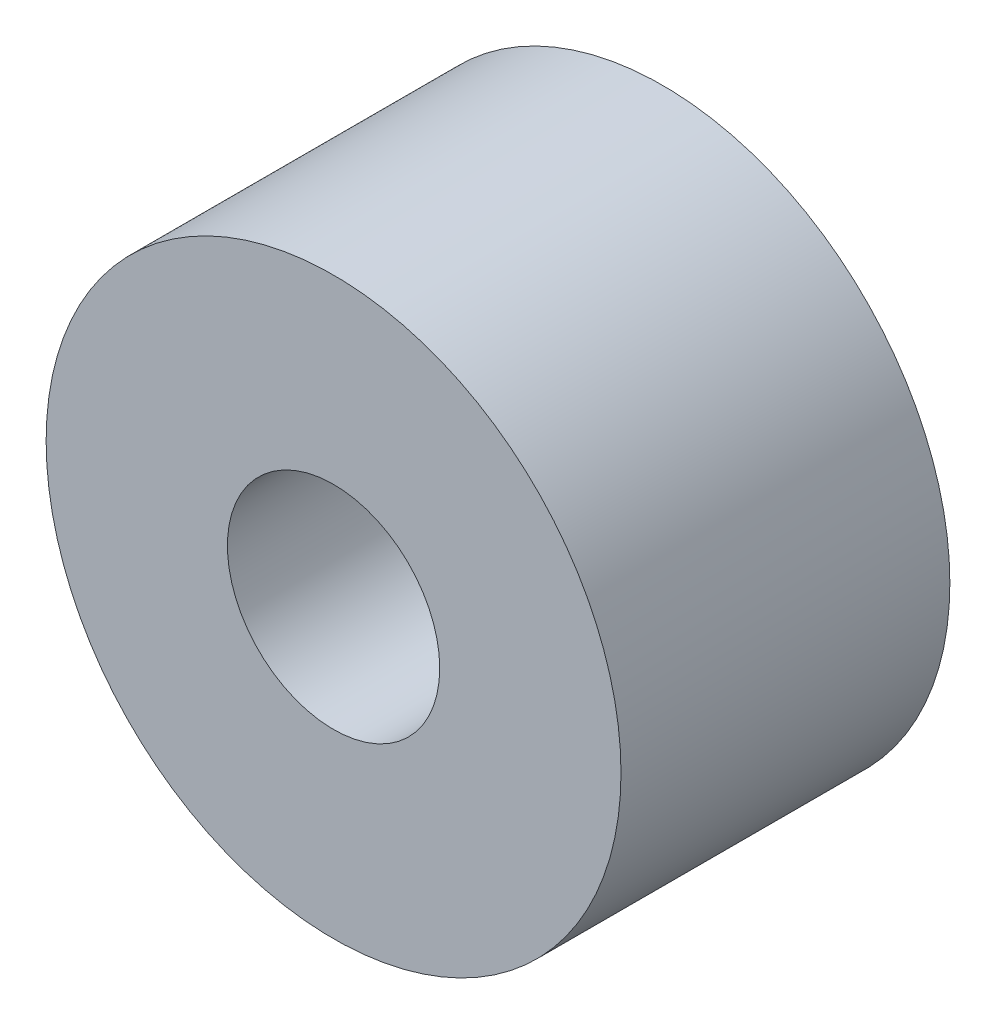
ISO-10303-21;
HEADER;
FILE_DESCRIPTION(('STEP AP214'),'2;1');
FILE_NAME('part.step','',(''),(''),'','','');
FILE_SCHEMA(('AUTOMOTIVE_DESIGN { 1 0 10303 214 1 1 1 1 }'));
ENDSEC;
DATA;
#1=APPLICATION_CONTEXT('core data for automotive mechanical design processes');
#2=APPLICATION_PROTOCOL_DEFINITION('international standard','automotive_design',2000,#1);
#3=PRODUCT_CONTEXT('',#1,'mechanical');
#4=PRODUCT('Part','Part','',(#3));
#5=PRODUCT_RELATED_PRODUCT_CATEGORY('part','',(#4));
#6=PRODUCT_DEFINITION_FORMATION('','',#4);
#7=PRODUCT_DEFINITION_CONTEXT('part definition',#1,'design');
#8=PRODUCT_DEFINITION('design','',#6,#7);
#9=PRODUCT_DEFINITION_SHAPE('','',#8);
#10=(LENGTH_UNIT() NAMED_UNIT(*) SI_UNIT(.MILLI.,.METRE.));
#11=(NAMED_UNIT(*) PLANE_ANGLE_UNIT() SI_UNIT($,.RADIAN.));
#12=(NAMED_UNIT(*) SI_UNIT($,.STERADIAN.) SOLID_ANGLE_UNIT());
#13=UNCERTAINTY_MEASURE_WITH_UNIT(LENGTH_MEASURE(1.E-05),#10,'distance_accuracy_value','');
#14=(GEOMETRIC_REPRESENTATION_CONTEXT(3) GLOBAL_UNCERTAINTY_ASSIGNED_CONTEXT((#13)) GLOBAL_UNIT_ASSIGNED_CONTEXT((#10,
#11,#12)) REPRESENTATION_CONTEXT('',''));
#15=CARTESIAN_POINT('',(0.,0.,0.));
#16=DIRECTION('',(0.,0.,1.));
#17=DIRECTION('',(1.,0.,0.));
#18=AXIS2_PLACEMENT_3D('',#15,#16,#17);
#19=CARTESIAN_POINT('',(0.,0.,6.35));
#20=DIRECTION('',(0.,0.,1.));
#21=DIRECTION('',(1.,0.,0.));
#22=AXIS2_PLACEMENT_3D('',#19,#20,#21);
#23=PLANE('',#22);
#24=CARTESIAN_POINT('',(0.,0.,6.35));
#25=DIRECTION('',(0.,0.,1.));
#26=DIRECTION('',(1.,0.,0.));
#27=AXIS2_PLACEMENT_3D('',#24,#25,#26);
#28=CIRCLE('',#27,5.55);
#29=CARTESIAN_POINT('',(5.55,0.,6.35));
#30=VERTEX_POINT('',#29);
#31=EDGE_CURVE('E10',#30,#30,#28,.T.);
#32=ORIENTED_EDGE('',*,*,#31,.T.);
#33=EDGE_LOOP('',(#32));
#34=FACE_BOUND('',#33,.T.);
#35=CARTESIAN_POINT('',(0.,0.,6.35));
#36=DIRECTION('',(0.,0.,1.));
#37=DIRECTION('',(1.,0.,0.));
#38=AXIS2_PLACEMENT_3D('',#35,#36,#37);
#39=CIRCLE('',#38,2.05);
#40=CARTESIAN_POINT('',(2.05,0.,6.35));
#41=VERTEX_POINT('',#40);
#42=EDGE_CURVE('E56',#41,#41,#39,.T.);
#43=ORIENTED_EDGE('',*,*,#42,.F.);
#44=EDGE_LOOP('',(#43));
#45=FACE_BOUND('',#44,.T.);
#46=ADVANCED_FACE('F43',(#34,#45),#23,.T.);
#47=CARTESIAN_POINT('',(0.,0.,0.));
#48=DIRECTION('',(0.,0.,1.));
#49=DIRECTION('',(1.,0.,0.));
#50=AXIS2_PLACEMENT_3D('',#47,#48,#49);
#51=PLANE('',#50);
#52=CARTESIAN_POINT('',(0.,0.,0.));
#53=DIRECTION('',(0.,0.,1.));
#54=DIRECTION('',(1.,0.,0.));
#55=AXIS2_PLACEMENT_3D('',#52,#53,#54);
#56=CIRCLE('',#55,5.55);
#57=CARTESIAN_POINT('',(5.55,0.,0.));
#58=VERTEX_POINT('',#57);
#59=EDGE_CURVE('E47',#58,#58,#56,.T.);
#60=ORIENTED_EDGE('',*,*,#59,.F.);
#61=EDGE_LOOP('',(#60));
#62=FACE_BOUND('',#61,.T.);
#63=CARTESIAN_POINT('',(0.,0.,0.));
#64=DIRECTION('',(0.,0.,1.));
#65=DIRECTION('',(1.,0.,0.));
#66=AXIS2_PLACEMENT_3D('',#63,#64,#65);
#67=CIRCLE('',#66,2.05);
#68=CARTESIAN_POINT('',(2.05,0.,0.));
#69=VERTEX_POINT('',#68);
#70=EDGE_CURVE('E58',#69,#69,#67,.T.);
#71=ORIENTED_EDGE('',*,*,#70,.T.);
#72=EDGE_LOOP('',(#71));
#73=FACE_BOUND('',#72,.T.);
#74=ADVANCED_FACE('F70',(#62,#73),#51,.F.);
#75=CARTESIAN_POINT('',(0.,0.,6.35));
#76=DIRECTION('',(0.,0.,-1.));
#77=DIRECTION('',(-1.,0.,0.));
#78=AXIS2_PLACEMENT_3D('',#75,#76,#77);
#79=CYLINDRICAL_SURFACE('',#78,5.55);
#80=ORIENTED_EDGE('',*,*,#31,.F.);
#81=EDGE_LOOP('',(#80));
#82=FACE_BOUND('',#81,.T.);
#83=ORIENTED_EDGE('',*,*,#59,.T.);
#84=EDGE_LOOP('',(#83));
#85=FACE_BOUND('',#84,.T.);
#86=ADVANCED_FACE('F45',(#82,#85),#79,.T.);
#87=CARTESIAN_POINT('',(0.,0.,6.35));
#88=DIRECTION('',(0.,0.,-1.));
#89=DIRECTION('',(-1.,0.,0.));
#90=AXIS2_PLACEMENT_3D('',#87,#88,#89);
#91=CYLINDRICAL_SURFACE('',#90,2.05);
#92=ORIENTED_EDGE('',*,*,#42,.T.);
#93=EDGE_LOOP('',(#92));
#94=FACE_BOUND('',#93,.T.);
#95=ORIENTED_EDGE('',*,*,#70,.F.);
#96=EDGE_LOOP('',(#95));
#97=FACE_BOUND('',#96,.T.);
#98=ADVANCED_FACE('F66',(#94,#97),#91,.F.);
#99=CLOSED_SHELL('',(#46,#74,#86,#98));
#100=MANIFOLD_SOLID_BREP('B2',#99);
#101=ADVANCED_BREP_SHAPE_REPRESENTATION('',(#18,#100),#14);
#102=SHAPE_DEFINITION_REPRESENTATION(#9,#101);
ENDSEC;
END-ISO-10303-21;
